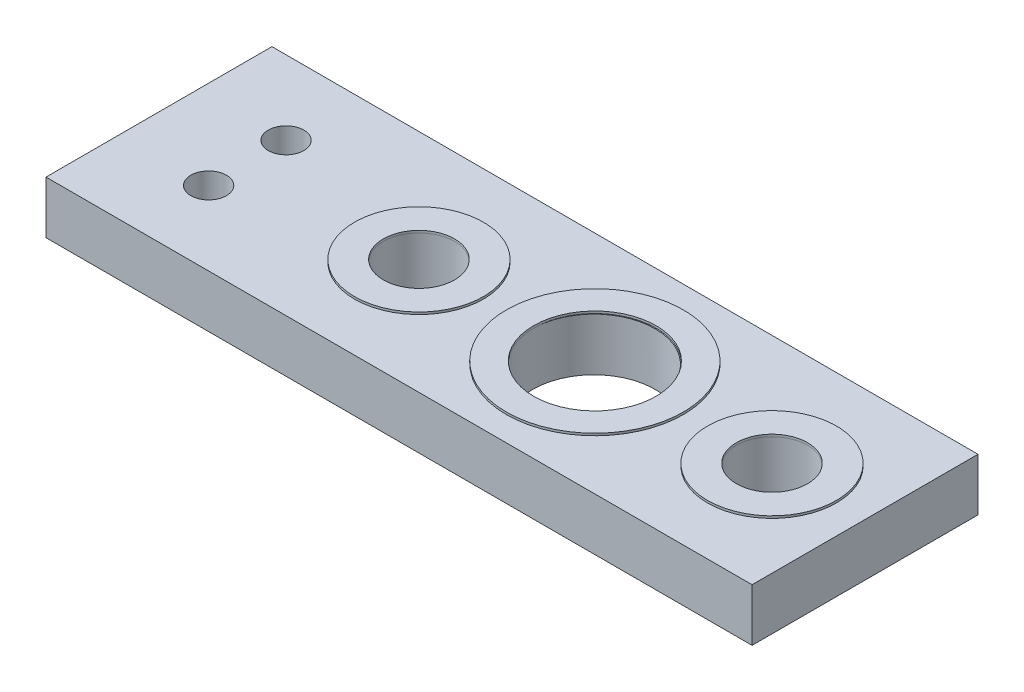
ISO-10303-21;
HEADER;
FILE_DESCRIPTION(('STEP AP214'),'2;1');
FILE_NAME('part.step','',(''),(''),'','','');
FILE_SCHEMA(('AUTOMOTIVE_DESIGN { 1 0 10303 214 1 1 1 1 }'));
ENDSEC;
DATA;
#1=APPLICATION_CONTEXT('core data for automotive mechanical design processes');
#2=APPLICATION_PROTOCOL_DEFINITION('international standard','automotive_design',2000,#1);
#3=PRODUCT_CONTEXT('',#1,'mechanical');
#4=PRODUCT('Part','Part','',(#3));
#5=PRODUCT_RELATED_PRODUCT_CATEGORY('part','',(#4));
#6=PRODUCT_DEFINITION_FORMATION('','',#4);
#7=PRODUCT_DEFINITION_CONTEXT('part definition',#1,'design');
#8=PRODUCT_DEFINITION('design','',#6,#7);
#9=PRODUCT_DEFINITION_SHAPE('','',#8);
#10=(LENGTH_UNIT() NAMED_UNIT(*) SI_UNIT(.MILLI.,.METRE.));
#11=(NAMED_UNIT(*) PLANE_ANGLE_UNIT() SI_UNIT($,.RADIAN.));
#12=(NAMED_UNIT(*) SI_UNIT($,.STERADIAN.) SOLID_ANGLE_UNIT());
#13=UNCERTAINTY_MEASURE_WITH_UNIT(LENGTH_MEASURE(1.E-05),#10,'distance_accuracy_value','');
#14=(GEOMETRIC_REPRESENTATION_CONTEXT(3) GLOBAL_UNCERTAINTY_ASSIGNED_CONTEXT((#13)) GLOBAL_UNIT_ASSIGNED_CONTEXT((#10,
#11,#12)) REPRESENTATION_CONTEXT('',''));
#15=CARTESIAN_POINT('',(0.,0.,0.));
#16=DIRECTION('',(0.,0.,1.));
#17=DIRECTION('',(1.,0.,0.));
#18=AXIS2_PLACEMENT_3D('',#15,#16,#17);
#19=CARTESIAN_POINT('',(0.,2.3622,0.));
#20=DIRECTION('',(0.,1.,0.));
#21=DIRECTION('',(0.,0.,1.));
#22=AXIS2_PLACEMENT_3D('',#19,#20,#21);
#23=PLANE('',#22);
#24=CARTESIAN_POINT('',(23.9011023548748,2.3622,-12.093517688659));
#25=DIRECTION('',(0.,1.,0.));
#26=DIRECTION('',(0.,0.,1.));
#27=AXIS2_PLACEMENT_3D('',#24,#25,#26);
#28=CIRCLE('',#27,2.75286662);
#29=CARTESIAN_POINT('',(26.6536811773972,2.3622,-12.0537124966418));
#30=VERTEX_POINT('',#29);
#31=CARTESIAN_POINT('',(21.1482384899858,2.3622,-12.0896229616712));
#32=VERTEX_POINT('',#31);
#33=EDGE_CURVE('E144',#30,#32,#28,.T.);
#34=ORIENTED_EDGE('',*,*,#33,.T.);
#35=CARTESIAN_POINT('',(23.9008173106109,2.3622,-12.0498174787899));
#36=DIRECTION('',(0.,1.,0.));
#37=DIRECTION('',(0.,0.,1.));
#38=AXIS2_PLACEMENT_3D('',#35,#36,#37);
#39=CIRCLE('',#38,2.75286662230875);
#40=EDGE_CURVE('E196',#30,#32,#39,.T.);
#41=ORIENTED_EDGE('',*,*,#40,.F.);
#42=EDGE_LOOP('',(#34,#41));
#43=FACE_BOUND('',#42,.T.);
#44=ADVANCED_FACE('F126',(#43),#23,.T.);
#45=CARTESIAN_POINT('',(23.9011023548748,2.3622,-12.093517688659));
#46=DIRECTION('',(0.,1.,0.));
#47=DIRECTION('',(0.,0.,1.));
#48=AXIS2_PLACEMENT_3D('',#45,#46,#47);
#49=CIRCLE('',#48,3.98);
#50=CARTESIAN_POINT('',(23.9011023548748,2.3622,-8.11351768865895));
#51=VERTEX_POINT('',#50);
#52=EDGE_CURVE('E398',#51,#51,#49,.T.);
#53=ORIENTED_EDGE('',*,*,#52,.F.);
#54=EDGE_LOOP('',(#53));
#55=FACE_BOUND('',#54,.T.);
#56=CARTESIAN_POINT('',(15.9901023548748,2.3622,-12.093517688659));
#57=DIRECTION('',(0.,1.,0.));
#58=DIRECTION('',(0.,0.,1.));
#59=AXIS2_PLACEMENT_3D('',#56,#57,#58);
#60=CIRCLE('',#59,2.899);
#61=CARTESIAN_POINT('',(15.9901023548748,2.3622,-9.19451768865896));
#62=VERTEX_POINT('',#61);
#63=EDGE_CURVE('E302',#62,#62,#60,.T.);
#64=ORIENTED_EDGE('',*,*,#63,.F.);
#65=EDGE_LOOP('',(#64));
#66=FACE_BOUND('',#65,.T.);
#67=CARTESIAN_POINT('',(31.8651023548748,2.3622,-12.093517688659));
#68=DIRECTION('',(0.,1.,0.));
#69=DIRECTION('',(0.,0.,1.));
#70=AXIS2_PLACEMENT_3D('',#67,#68,#69);
#71=CIRCLE('',#70,2.899);
#72=CARTESIAN_POINT('',(31.8651023548748,2.3622,-9.19451768865896));
#73=VERTEX_POINT('',#72);
#74=EDGE_CURVE('E12',#73,#73,#71,.T.);
#75=ORIENTED_EDGE('',*,*,#74,.F.);
#76=EDGE_LOOP('',(#75));
#77=FACE_BOUND('',#76,.T.);
#78=CARTESIAN_POINT('',(8.28105915464621,2.3622,-10.3450495024151));
#79=DIRECTION('',(0.,1.,0.));
#80=DIRECTION('',(0.,0.,1.));
#81=AXIS2_PLACEMENT_3D('',#78,#79,#80);
#82=CIRCLE('',#81,0.800000000000001);
#83=CARTESIAN_POINT('',(8.28105915464621,2.3622,-9.54504950241508));
#84=VERTEX_POINT('',#83);
#85=EDGE_CURVE('E215',#84,#84,#82,.T.);
#86=ORIENTED_EDGE('',*,*,#85,.F.);
#87=EDGE_LOOP('',(#86));
#88=FACE_BOUND('',#87,.T.);
#89=DIRECTION('',(0.,0.,1.));
#90=VECTOR('',#89,1.);
#91=CARTESIAN_POINT('',(4.29910235487482,2.3622,-17.173517688659));
#92=LINE('',#91,#90);
#93=CARTESIAN_POINT('',(4.29910235487482,2.3622,-17.173517688659));
#94=VERTEX_POINT('',#93);
#95=CARTESIAN_POINT('',(4.29910235487482,2.3622,-7.01351768865896));
#96=VERTEX_POINT('',#95);
#97=EDGE_CURVE('E221',#94,#96,#92,.T.);
#98=ORIENTED_EDGE('',*,*,#97,.T.);
#99=DIRECTION('',(1.,0.,0.));
#100=VECTOR('',#99,1.);
#101=CARTESIAN_POINT('',(4.29910235487482,2.3622,-7.01351768865896));
#102=LINE('',#101,#100);
#103=CARTESIAN_POINT('',(36.0491023548748,2.3622,-7.01351768865896));
#104=VERTEX_POINT('',#103);
#105=EDGE_CURVE('E224',#96,#104,#102,.T.);
#106=ORIENTED_EDGE('',*,*,#105,.T.);
#107=DIRECTION('',(0.,0.,1.));
#108=VECTOR('',#107,1.);
#109=CARTESIAN_POINT('',(36.0491023548748,2.3622,-17.173517688659));
#110=LINE('',#109,#108);
#111=CARTESIAN_POINT('',(36.0491023548748,2.3622,-17.173517688659));
#112=VERTEX_POINT('',#111);
#113=EDGE_CURVE('E227',#112,#104,#110,.T.);
#114=ORIENTED_EDGE('',*,*,#113,.F.);
#115=DIRECTION('',(1.,0.,0.));
#116=VECTOR('',#115,1.);
#117=CARTESIAN_POINT('',(4.29910235487482,2.3622,-17.173517688659));
#118=LINE('',#117,#116);
#119=EDGE_CURVE('E230',#94,#112,#118,.T.);
#120=ORIENTED_EDGE('',*,*,#119,.F.);
#121=EDGE_LOOP('',(#98,#106,#114,#120));
#122=FACE_BOUND('',#121,.T.);
#123=CARTESIAN_POINT('',(8.26614257332873,2.3622,-13.842017688659));
#124=DIRECTION('',(0.,1.,0.));
#125=DIRECTION('',(0.,0.,1.));
#126=AXIS2_PLACEMENT_3D('',#123,#124,#125);
#127=CIRCLE('',#126,0.800000000000001);
#128=CARTESIAN_POINT('',(8.26614257332873,2.3622,-13.042017688659));
#129=VERTEX_POINT('',#128);
#130=EDGE_CURVE('E357',#129,#129,#127,.T.);
#131=ORIENTED_EDGE('',*,*,#130,.F.);
#132=EDGE_LOOP('',(#131));
#133=FACE_BOUND('',#132,.T.);
#134=ADVANCED_FACE('F275',(#55,#66,#77,#88,#122,#133),#23,.T.);
#135=CARTESIAN_POINT('',(0.,0.,0.));
#136=DIRECTION('',(0.,1.,0.));
#137=DIRECTION('',(0.,0.,1.));
#138=AXIS2_PLACEMENT_3D('',#135,#136,#137);
#139=PLANE('',#138);
#140=DIRECTION('',(0.,0.,1.));
#141=VECTOR('',#140,1.);
#142=CARTESIAN_POINT('',(4.29910235487482,0.,-17.173517688659));
#143=LINE('',#142,#141);
#144=CARTESIAN_POINT('',(4.29910235487482,0.,-17.173517688659));
#145=VERTEX_POINT('',#144);
#146=CARTESIAN_POINT('',(4.29910235487482,0.,-7.01351768865896));
#147=VERTEX_POINT('',#146);
#148=EDGE_CURVE('E234',#145,#147,#143,.T.);
#149=ORIENTED_EDGE('',*,*,#148,.F.);
#150=DIRECTION('',(1.,0.,0.));
#151=VECTOR('',#150,1.);
#152=CARTESIAN_POINT('',(4.29910235487482,0.,-17.173517688659));
#153=LINE('',#152,#151);
#154=CARTESIAN_POINT('',(36.0491023548748,0.,-17.173517688659));
#155=VERTEX_POINT('',#154);
#156=EDGE_CURVE('E225',#145,#155,#153,.T.);
#157=ORIENTED_EDGE('',*,*,#156,.T.);
#158=DIRECTION('',(0.,0.,1.));
#159=VECTOR('',#158,1.);
#160=CARTESIAN_POINT('',(36.0491023548748,0.,-17.173517688659));
#161=LINE('',#160,#159);
#162=CARTESIAN_POINT('',(36.0491023548748,0.,-7.01351768865896));
#163=VERTEX_POINT('',#162);
#164=EDGE_CURVE('E240',#155,#163,#161,.T.);
#165=ORIENTED_EDGE('',*,*,#164,.T.);
#166=DIRECTION('',(1.,0.,0.));
#167=VECTOR('',#166,1.);
#168=CARTESIAN_POINT('',(4.29910235487482,0.,-7.01351768865896));
#169=LINE('',#168,#167);
#170=EDGE_CURVE('E237',#147,#163,#169,.T.);
#171=ORIENTED_EDGE('',*,*,#170,.F.);
#172=EDGE_LOOP('',(#149,#157,#165,#171));
#173=FACE_BOUND('',#172,.T.);
#174=CARTESIAN_POINT('',(31.8646423230799,0.,-12.093517688659));
#175=DIRECTION('',(0.,1.,0.));
#176=DIRECTION('',(0.,0.,1.));
#177=AXIS2_PLACEMENT_3D('',#174,#175,#176);
#178=CIRCLE('',#177,1.60011781);
#179=CARTESIAN_POINT('',(31.8646423230799,0.,-10.493399878659));
#180=VERTEX_POINT('',#179);
#181=EDGE_CURVE('E217',#180,#180,#178,.T.);
#182=ORIENTED_EDGE('',*,*,#181,.T.);
#183=EDGE_LOOP('',(#182));
#184=FACE_BOUND('',#183,.T.);
#185=CARTESIAN_POINT('',(15.9896423230799,0.,-12.093517688659));
#186=DIRECTION('',(0.,1.,0.));
#187=DIRECTION('',(0.,0.,1.));
#188=AXIS2_PLACEMENT_3D('',#185,#186,#187);
#189=CIRCLE('',#188,1.60011780970894);
#190=CARTESIAN_POINT('',(15.9896423230799,0.,-10.49339987895));
#191=VERTEX_POINT('',#190);
#192=EDGE_CURVE('E206',#191,#191,#189,.T.);
#193=ORIENTED_EDGE('',*,*,#192,.T.);
#194=EDGE_LOOP('',(#193));
#195=FACE_BOUND('',#194,.T.);
#196=CARTESIAN_POINT('',(23.9008173106109,0.,-12.0498174787899));
#197=DIRECTION('',(0.,1.,0.));
#198=DIRECTION('',(0.,0.,1.));
#199=AXIS2_PLACEMENT_3D('',#196,#197,#198);
#200=CIRCLE('',#199,2.75286662230875);
#201=CARTESIAN_POINT('',(23.9008173106109,0.,-9.29695085648117));
#202=VERTEX_POINT('',#201);
#203=EDGE_CURVE('E197',#202,#202,#200,.T.);
#204=ORIENTED_EDGE('',*,*,#203,.T.);
#205=EDGE_LOOP('',(#204));
#206=FACE_BOUND('',#205,.T.);
#207=CARTESIAN_POINT('',(8.28105915464621,0.,-10.3450495024151));
#208=DIRECTION('',(0.,1.,0.));
#209=DIRECTION('',(0.,0.,1.));
#210=AXIS2_PLACEMENT_3D('',#207,#208,#209);
#211=CIRCLE('',#210,0.800000000000001);
#212=CARTESIAN_POINT('',(8.28105915464621,0.,-9.54504950241508));
#213=VERTEX_POINT('',#212);
#214=EDGE_CURVE('E212',#213,#213,#211,.T.);
#215=ORIENTED_EDGE('',*,*,#214,.T.);
#216=EDGE_LOOP('',(#215));
#217=FACE_BOUND('',#216,.T.);
#218=CARTESIAN_POINT('',(8.26614257332873,0.,-13.842017688659));
#219=DIRECTION('',(0.,1.,0.));
#220=DIRECTION('',(0.,0.,1.));
#221=AXIS2_PLACEMENT_3D('',#218,#219,#220);
#222=CIRCLE('',#221,0.800000000000001);
#223=CARTESIAN_POINT('',(8.26614257332873,0.,-13.042017688659));
#224=VERTEX_POINT('',#223);
#225=EDGE_CURVE('E341',#224,#224,#222,.T.);
#226=ORIENTED_EDGE('',*,*,#225,.T.);
#227=EDGE_LOOP('',(#226));
#228=FACE_BOUND('',#227,.T.);
#229=ADVANCED_FACE('F372',(#173,#184,#195,#206,#217,#228),#139,.F.);
#230=CARTESIAN_POINT('',(4.29910235487482,2.3622,-17.173517688659));
#231=DIRECTION('',(1.,0.,0.));
#232=DIRECTION('',(0.,0.,-1.));
#233=AXIS2_PLACEMENT_3D('',#230,#231,#232);
#234=PLANE('',#233);
#235=ORIENTED_EDGE('',*,*,#148,.T.);
#236=DIRECTION('',(0.,-1.,0.));
#237=VECTOR('',#236,1.);
#238=CARTESIAN_POINT('',(4.29910235487482,2.3622,-7.01351768865896));
#239=LINE('',#238,#237);
#240=EDGE_CURVE('E250',#96,#147,#239,.T.);
#241=ORIENTED_EDGE('',*,*,#240,.F.);
#242=ORIENTED_EDGE('',*,*,#97,.F.);
#243=DIRECTION('',(0.,-1.,0.));
#244=VECTOR('',#243,1.);
#245=CARTESIAN_POINT('',(4.29910235487482,2.3622,-17.173517688659));
#246=LINE('',#245,#244);
#247=EDGE_CURVE('E233',#94,#145,#246,.T.);
#248=ORIENTED_EDGE('',*,*,#247,.T.);
#249=EDGE_LOOP('',(#235,#241,#242,#248));
#250=FACE_BOUND('',#249,.T.);
#251=ADVANCED_FACE('F128',(#250),#234,.F.);
#252=CARTESIAN_POINT('',(4.29910235487482,2.3622,-7.01351768865896));
#253=DIRECTION('',(0.,0.,-1.));
#254=DIRECTION('',(-1.,0.,0.));
#255=AXIS2_PLACEMENT_3D('',#252,#253,#254);
#256=PLANE('',#255);
#257=ORIENTED_EDGE('',*,*,#170,.T.);
#258=DIRECTION('',(0.,-1.,0.));
#259=VECTOR('',#258,1.);
#260=CARTESIAN_POINT('',(36.0491023548748,2.3622,-7.01351768865896));
#261=LINE('',#260,#259);
#262=EDGE_CURVE('E248',#104,#163,#261,.T.);
#263=ORIENTED_EDGE('',*,*,#262,.F.);
#264=ORIENTED_EDGE('',*,*,#105,.F.);
#265=ORIENTED_EDGE('',*,*,#240,.T.);
#266=EDGE_LOOP('',(#257,#263,#264,#265));
#267=FACE_BOUND('',#266,.T.);
#268=ADVANCED_FACE('F416',(#267),#256,.F.);
#269=CARTESIAN_POINT('',(36.0491023548748,2.3622,-17.173517688659));
#270=DIRECTION('',(1.,0.,0.));
#271=DIRECTION('',(0.,0.,-1.));
#272=AXIS2_PLACEMENT_3D('',#269,#270,#271);
#273=PLANE('',#272);
#274=ORIENTED_EDGE('',*,*,#164,.F.);
#275=DIRECTION('',(0.,-1.,0.));
#276=VECTOR('',#275,1.);
#277=CARTESIAN_POINT('',(36.0491023548748,2.3622,-17.173517688659));
#278=LINE('',#277,#276);
#279=EDGE_CURVE('E246',#112,#155,#278,.T.);
#280=ORIENTED_EDGE('',*,*,#279,.F.);
#281=ORIENTED_EDGE('',*,*,#113,.T.);
#282=ORIENTED_EDGE('',*,*,#262,.T.);
#283=EDGE_LOOP('',(#274,#280,#281,#282));
#284=FACE_BOUND('',#283,.T.);
#285=ADVANCED_FACE('F419',(#284),#273,.T.);
#286=CARTESIAN_POINT('',(4.29910235487482,2.3622,-17.173517688659));
#287=DIRECTION('',(0.,0.,-1.));
#288=DIRECTION('',(-1.,0.,0.));
#289=AXIS2_PLACEMENT_3D('',#286,#287,#288);
#290=PLANE('',#289);
#291=ORIENTED_EDGE('',*,*,#156,.F.);
#292=ORIENTED_EDGE('',*,*,#247,.F.);
#293=ORIENTED_EDGE('',*,*,#119,.T.);
#294=ORIENTED_EDGE('',*,*,#279,.T.);
#295=EDGE_LOOP('',(#291,#292,#293,#294));
#296=FACE_BOUND('',#295,.T.);
#297=ADVANCED_FACE('F272',(#296),#290,.T.);
#298=CARTESIAN_POINT('',(31.8646423230799,2.3622,-12.093517688659));
#299=DIRECTION('',(0.,-1.,0.));
#300=DIRECTION('',(0.,0.,-1.));
#301=AXIS2_PLACEMENT_3D('',#298,#299,#300);
#302=CYLINDRICAL_SURFACE('',#301,1.60011781);
#303=CARTESIAN_POINT('',(31.8646423230799,2.3622,-12.093517688659));
#304=DIRECTION('',(0.,1.,0.));
#305=DIRECTION('',(0.000143749343931746,0.,0.999999989668063));
#306=AXIS2_PLACEMENT_3D('',#303,#304,#305);
#307=CIRCLE('',#306,1.60011781);
#308=CARTESIAN_POINT('',(31.8648723389653,2.3622,-10.4933998951913));
#309=VERTEX_POINT('',#308);
#310=CARTESIAN_POINT('',(31.8648723389894,2.3622,-13.6936354821266));
#311=VERTEX_POINT('',#310);
#312=EDGE_CURVE('E137',#309,#311,#307,.T.);
#313=ORIENTED_EDGE('',*,*,#312,.T.);
#314=CARTESIAN_POINT('',(31.8646423230799,2.3622,-12.093517688659));
#315=DIRECTION('',(0.,1.,0.));
#316=DIRECTION('',(0.000143749359014056,0.,-0.999999989668061));
#317=AXIS2_PLACEMENT_3D('',#314,#315,#316);
#318=CIRCLE('',#317,1.60011781);
#319=EDGE_CURVE('E220',#311,#309,#318,.T.);
#320=ORIENTED_EDGE('',*,*,#319,.T.);
#321=EDGE_LOOP('',(#313,#320));
#322=FACE_BOUND('',#321,.T.);
#323=ORIENTED_EDGE('',*,*,#181,.F.);
#324=EDGE_LOOP('',(#323));
#325=FACE_BOUND('',#324,.T.);
#326=ADVANCED_FACE('F262',(#322,#325),#302,.F.);
#327=CARTESIAN_POINT('',(15.9896423230799,2.3622,-12.093517688659));
#328=DIRECTION('',(0.,-1.,0.));
#329=DIRECTION('',(0.,0.,-1.));
#330=AXIS2_PLACEMENT_3D('',#327,#328,#329);
#331=CYLINDRICAL_SURFACE('',#330,1.60011780970894);
#332=CARTESIAN_POINT('',(15.9896423230799,2.3622,-12.093517688659));
#333=DIRECTION('',(0.,1.,0.));
#334=DIRECTION('',(0.000143116652959493,0.,0.999999989758812));
#335=AXIS2_PLACEMENT_3D('',#332,#333,#334);
#336=CIRCLE('',#335,1.60011780970894);
#337=CARTESIAN_POINT('',(15.9898713265851,2.3622,-10.4933998953371));
#338=VERTEX_POINT('',#337);
#339=CARTESIAN_POINT('',(15.9898713265851,2.3622,-13.6936354819808));
#340=VERTEX_POINT('',#339);
#341=EDGE_CURVE('E151',#338,#340,#336,.T.);
#342=ORIENTED_EDGE('',*,*,#341,.T.);
#343=CARTESIAN_POINT('',(15.9896423230799,2.3622,-12.093517688659));
#344=DIRECTION('',(0.,1.,0.));
#345=DIRECTION('',(0.000143116652959493,0.,-0.999999989758812));
#346=AXIS2_PLACEMENT_3D('',#343,#344,#345);
#347=CIRCLE('',#346,1.60011780970894);
#348=EDGE_CURVE('E208',#340,#338,#347,.T.);
#349=ORIENTED_EDGE('',*,*,#348,.T.);
#350=EDGE_LOOP('',(#342,#349));
#351=FACE_BOUND('',#350,.T.);
#352=ORIENTED_EDGE('',*,*,#192,.F.);
#353=EDGE_LOOP('',(#352));
#354=FACE_BOUND('',#353,.T.);
#355=ADVANCED_FACE('F271',(#351,#354),#331,.F.);
#356=CARTESIAN_POINT('',(23.9008173106109,2.3622,-12.0498174787899));
#357=DIRECTION('',(0.,-1.,0.));
#358=DIRECTION('',(0.,0.,-1.));
#359=AXIS2_PLACEMENT_3D('',#356,#357,#358);
#360=CYLINDRICAL_SURFACE('',#359,2.75286662230875);
#361=ORIENTED_EDGE('',*,*,#40,.T.);
#362=EDGE_CURVE('E190',#32,#30,#39,.T.);
#363=ORIENTED_EDGE('',*,*,#362,.T.);
#364=EDGE_LOOP('',(#361,#363));
#365=FACE_BOUND('',#364,.T.);
#366=ORIENTED_EDGE('',*,*,#203,.F.);
#367=EDGE_LOOP('',(#366));
#368=FACE_BOUND('',#367,.T.);
#369=ADVANCED_FACE('F204',(#365,#368),#360,.F.);
#370=CARTESIAN_POINT('',(8.28105915464621,2.3622,-10.3450495024151));
#371=DIRECTION('',(0.,-1.,0.));
#372=DIRECTION('',(0.,0.,-1.));
#373=AXIS2_PLACEMENT_3D('',#370,#371,#372);
#374=CYLINDRICAL_SURFACE('',#373,0.800000000000001);
#375=ORIENTED_EDGE('',*,*,#85,.T.);
#376=EDGE_LOOP('',(#375));
#377=FACE_BOUND('',#376,.T.);
#378=ORIENTED_EDGE('',*,*,#214,.F.);
#379=EDGE_LOOP('',(#378));
#380=FACE_BOUND('',#379,.T.);
#381=ADVANCED_FACE('F375',(#377,#380),#374,.F.);
#382=CARTESIAN_POINT('',(8.26614257332873,2.3622,-13.842017688659));
#383=DIRECTION('',(0.,-1.,0.));
#384=DIRECTION('',(0.,0.,-1.));
#385=AXIS2_PLACEMENT_3D('',#382,#383,#384);
#386=CYLINDRICAL_SURFACE('',#385,0.800000000000001);
#387=ORIENTED_EDGE('',*,*,#130,.T.);
#388=EDGE_LOOP('',(#387));
#389=FACE_BOUND('',#388,.T.);
#390=ORIENTED_EDGE('',*,*,#225,.F.);
#391=EDGE_LOOP('',(#390));
#392=FACE_BOUND('',#391,.T.);
#393=ADVANCED_FACE('F377',(#389,#392),#386,.F.);
#394=CARTESIAN_POINT('',(31.8651023548748,2.4622,-12.093517688659));
#395=DIRECTION('',(0.,1.,0.));
#396=DIRECTION('',(0.,0.,1.));
#397=AXIS2_PLACEMENT_3D('',#394,#395,#396);
#398=PLANE('',#397);
#399=CARTESIAN_POINT('',(31.8651023548748,2.4622,-12.093517688659));
#400=DIRECTION('',(0.,1.,0.));
#401=DIRECTION('',(0.,0.,1.));
#402=AXIS2_PLACEMENT_3D('',#399,#400,#401);
#403=CIRCLE('',#402,2.899);
#404=CARTESIAN_POINT('',(31.8651023548748,2.4622,-9.19451768865896));
#405=VERTEX_POINT('',#404);
#406=EDGE_CURVE('E299',#405,#405,#403,.T.);
#407=ORIENTED_EDGE('',*,*,#406,.T.);
#408=EDGE_LOOP('',(#407));
#409=FACE_BOUND('',#408,.T.);
#410=CARTESIAN_POINT('',(31.8651023548748,2.4622,-12.093517688659));
#411=DIRECTION('',(0.,1.,0.));
#412=DIRECTION('',(0.,0.,1.));
#413=AXIS2_PLACEMENT_3D('',#410,#411,#412);
#414=CIRCLE('',#413,1.60011781);
#415=CARTESIAN_POINT('',(31.8651023548748,2.4622,-10.493399878659));
#416=VERTEX_POINT('',#415);
#417=EDGE_CURVE('E296',#416,#416,#414,.T.);
#418=ORIENTED_EDGE('',*,*,#417,.F.);
#419=EDGE_LOOP('',(#418));
#420=FACE_BOUND('',#419,.T.);
#421=ADVANCED_FACE('F383',(#409,#420),#398,.T.);
#422=CARTESIAN_POINT('',(31.8651023548748,2.4622,-12.093517688659));
#423=DIRECTION('',(0.,-1.,0.));
#424=DIRECTION('',(0.,0.,-1.));
#425=AXIS2_PLACEMENT_3D('',#422,#423,#424);
#426=CYLINDRICAL_SURFACE('',#425,2.899);
#427=ORIENTED_EDGE('',*,*,#406,.F.);
#428=EDGE_LOOP('',(#427));
#429=FACE_BOUND('',#428,.T.);
#430=ORIENTED_EDGE('',*,*,#74,.T.);
#431=EDGE_LOOP('',(#430));
#432=FACE_BOUND('',#431,.T.);
#433=ADVANCED_FACE('F448',(#429,#432),#426,.T.);
#434=CARTESIAN_POINT('',(31.8651023548748,2.4622,-12.093517688659));
#435=DIRECTION('',(0.,-1.,0.));
#436=DIRECTION('',(0.,0.,-1.));
#437=AXIS2_PLACEMENT_3D('',#434,#435,#436);
#438=CYLINDRICAL_SURFACE('',#437,1.60011781);
#439=ORIENTED_EDGE('',*,*,#417,.T.);
#440=EDGE_LOOP('',(#439));
#441=FACE_BOUND('',#440,.T.);
#442=ORIENTED_EDGE('',*,*,#319,.F.);
#443=ORIENTED_EDGE('',*,*,#312,.F.);
#444=EDGE_LOOP('',(#442,#443));
#445=FACE_BOUND('',#444,.T.);
#446=ADVANCED_FACE('F328',(#441,#445),#438,.F.);
#447=CARTESIAN_POINT('',(15.9901023548748,2.4622,-12.093517688659));
#448=DIRECTION('',(0.,1.,0.));
#449=DIRECTION('',(0.,0.,1.));
#450=AXIS2_PLACEMENT_3D('',#447,#448,#449);
#451=PLANE('',#450);
#452=CARTESIAN_POINT('',(15.9901023548748,2.4622,-12.093517688659));
#453=DIRECTION('',(0.,1.,0.));
#454=DIRECTION('',(0.,0.,1.));
#455=AXIS2_PLACEMENT_3D('',#452,#453,#454);
#456=CIRCLE('',#455,2.899);
#457=CARTESIAN_POINT('',(15.9901023548748,2.4622,-9.19451768865896));
#458=VERTEX_POINT('',#457);
#459=EDGE_CURVE('E203',#458,#458,#456,.T.);
#460=ORIENTED_EDGE('',*,*,#459,.T.);
#461=EDGE_LOOP('',(#460));
#462=FACE_BOUND('',#461,.T.);
#463=CARTESIAN_POINT('',(15.9901023548748,2.4622,-12.093517688659));
#464=DIRECTION('',(0.,1.,0.));
#465=DIRECTION('',(0.,0.,1.));
#466=AXIS2_PLACEMENT_3D('',#463,#464,#465);
#467=CIRCLE('',#466,1.60011781);
#468=CARTESIAN_POINT('',(15.9901023548748,2.4622,-10.493399878659));
#469=VERTEX_POINT('',#468);
#470=EDGE_CURVE('E297',#469,#469,#467,.T.);
#471=ORIENTED_EDGE('',*,*,#470,.F.);
#472=EDGE_LOOP('',(#471));
#473=FACE_BOUND('',#472,.T.);
#474=ADVANCED_FACE('F326',(#462,#473),#451,.T.);
#475=CARTESIAN_POINT('',(15.9901023548748,2.4622,-12.093517688659));
#476=DIRECTION('',(0.,-1.,0.));
#477=DIRECTION('',(0.,0.,-1.));
#478=AXIS2_PLACEMENT_3D('',#475,#476,#477);
#479=CYLINDRICAL_SURFACE('',#478,2.899);
#480=ORIENTED_EDGE('',*,*,#459,.F.);
#481=EDGE_LOOP('',(#480));
#482=FACE_BOUND('',#481,.T.);
#483=ORIENTED_EDGE('',*,*,#63,.T.);
#484=EDGE_LOOP('',(#483));
#485=FACE_BOUND('',#484,.T.);
#486=ADVANCED_FACE('F325',(#482,#485),#479,.T.);
#487=CARTESIAN_POINT('',(15.9901023548748,2.4622,-12.093517688659));
#488=DIRECTION('',(0.,-1.,0.));
#489=DIRECTION('',(0.,0.,-1.));
#490=AXIS2_PLACEMENT_3D('',#487,#488,#489);
#491=CYLINDRICAL_SURFACE('',#490,1.60011781);
#492=ORIENTED_EDGE('',*,*,#470,.T.);
#493=EDGE_LOOP('',(#492));
#494=FACE_BOUND('',#493,.T.);
#495=ORIENTED_EDGE('',*,*,#348,.F.);
#496=ORIENTED_EDGE('',*,*,#341,.F.);
#497=EDGE_LOOP('',(#495,#496));
#498=FACE_BOUND('',#497,.T.);
#499=ADVANCED_FACE('F315',(#494,#498),#491,.F.);
#500=CARTESIAN_POINT('',(23.9011023548748,2.3622,-12.093517688659));
#501=DIRECTION('',(0.,1.,0.));
#502=DIRECTION('',(0.,0.,1.));
#503=AXIS2_PLACEMENT_3D('',#500,#501,#502);
#504=PLANE('',#503);
#505=ORIENTED_EDGE('',*,*,#362,.F.);
#506=EDGE_CURVE('E192',#32,#30,#28,.T.);
#507=ORIENTED_EDGE('',*,*,#506,.T.);
#508=EDGE_LOOP('',(#505,#507));
#509=FACE_BOUND('',#508,.T.);
#510=ADVANCED_FACE('F191',(#509),#504,.F.);
#511=CARTESIAN_POINT('',(23.9011023548748,2.4622,-12.093517688659));
#512=DIRECTION('',(0.,1.,0.));
#513=DIRECTION('',(0.,0.,1.));
#514=AXIS2_PLACEMENT_3D('',#511,#512,#513);
#515=PLANE('',#514);
#516=CARTESIAN_POINT('',(23.9011023548748,2.4622,-12.093517688659));
#517=DIRECTION('',(0.,1.,0.));
#518=DIRECTION('',(0.,0.,1.));
#519=AXIS2_PLACEMENT_3D('',#516,#517,#518);
#520=CIRCLE('',#519,3.98);
#521=CARTESIAN_POINT('',(23.9011023548748,2.4622,-8.11351768865895));
#522=VERTEX_POINT('',#521);
#523=EDGE_CURVE('E533',#522,#522,#520,.T.);
#524=ORIENTED_EDGE('',*,*,#523,.T.);
#525=EDGE_LOOP('',(#524));
#526=FACE_BOUND('',#525,.T.);
#527=CARTESIAN_POINT('',(23.9011023548748,2.4622,-12.093517688659));
#528=DIRECTION('',(0.,1.,0.));
#529=DIRECTION('',(0.,0.,1.));
#530=AXIS2_PLACEMENT_3D('',#527,#528,#529);
#531=CIRCLE('',#530,2.75286662);
#532=CARTESIAN_POINT('',(23.9011023548748,2.4622,-9.34065106865896));
#533=VERTEX_POINT('',#532);
#534=EDGE_CURVE('E200',#533,#533,#531,.T.);
#535=ORIENTED_EDGE('',*,*,#534,.F.);
#536=EDGE_LOOP('',(#535));
#537=FACE_BOUND('',#536,.T.);
#538=ADVANCED_FACE('F497',(#526,#537),#515,.T.);
#539=CARTESIAN_POINT('',(23.9011023548748,2.4622,-12.093517688659));
#540=DIRECTION('',(0.,-1.,0.));
#541=DIRECTION('',(0.,0.,-1.));
#542=AXIS2_PLACEMENT_3D('',#539,#540,#541);
#543=CYLINDRICAL_SURFACE('',#542,3.98);
#544=ORIENTED_EDGE('',*,*,#523,.F.);
#545=EDGE_LOOP('',(#544));
#546=FACE_BOUND('',#545,.T.);
#547=ORIENTED_EDGE('',*,*,#52,.T.);
#548=EDGE_LOOP('',(#547));
#549=FACE_BOUND('',#548,.T.);
#550=ADVANCED_FACE('F506',(#546,#549),#543,.T.);
#551=CARTESIAN_POINT('',(23.9011023548748,2.4622,-12.093517688659));
#552=DIRECTION('',(0.,-1.,0.));
#553=DIRECTION('',(0.,0.,-1.));
#554=AXIS2_PLACEMENT_3D('',#551,#552,#553);
#555=CYLINDRICAL_SURFACE('',#554,2.75286662);
#556=ORIENTED_EDGE('',*,*,#534,.T.);
#557=EDGE_LOOP('',(#556));
#558=FACE_BOUND('',#557,.T.);
#559=ORIENTED_EDGE('',*,*,#33,.F.);
#560=ORIENTED_EDGE('',*,*,#506,.F.);
#561=EDGE_LOOP('',(#559,#560));
#562=FACE_BOUND('',#561,.T.);
#563=ADVANCED_FACE('F199',(#558,#562),#555,.F.);
#564=CLOSED_SHELL('',(#44,#134,#229,#251,#268,#285,#297,#326,#355,#369,#381,#393,#421,#433,#446,
#474,#486,#499,#510,#538,#550,#563));
#565=MANIFOLD_SOLID_BREP('B2',#564);
#566=ADVANCED_BREP_SHAPE_REPRESENTATION('',(#18,#565),#14);
#567=SHAPE_DEFINITION_REPRESENTATION(#9,#566);
ENDSEC;
END-ISO-10303-21;
